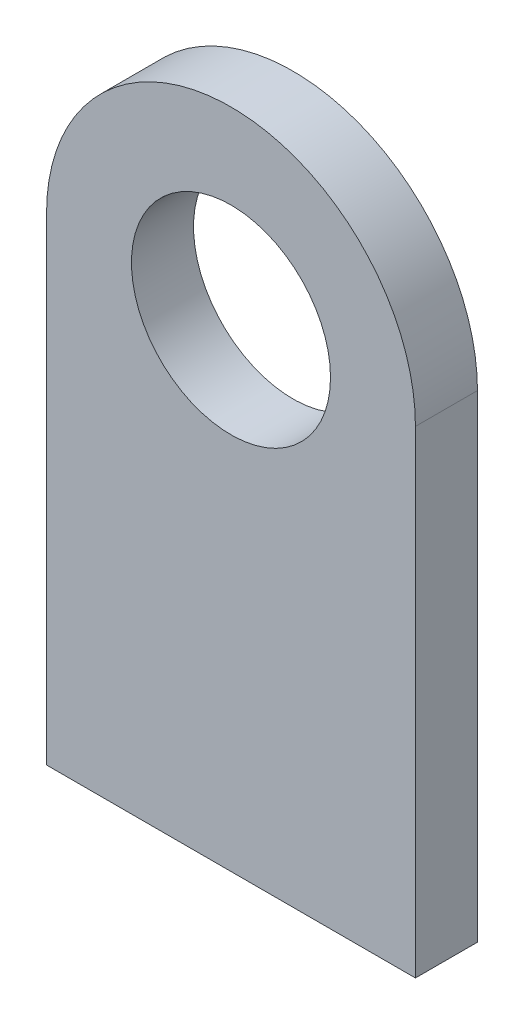
ISO-10303-21;
HEADER;
FILE_DESCRIPTION(('STEP AP214'),'2;1');
FILE_NAME('part.step','',(''),(''),'','','');
FILE_SCHEMA(('AUTOMOTIVE_DESIGN { 1 0 10303 214 1 1 1 1 }'));
ENDSEC;
DATA;
#1=APPLICATION_CONTEXT('core data for automotive mechanical design processes');
#2=APPLICATION_PROTOCOL_DEFINITION('international standard','automotive_design',2000,#1);
#3=PRODUCT_CONTEXT('',#1,'mechanical');
#4=PRODUCT('Part','Part','',(#3));
#5=PRODUCT_RELATED_PRODUCT_CATEGORY('part','',(#4));
#6=PRODUCT_DEFINITION_FORMATION('','',#4);
#7=PRODUCT_DEFINITION_CONTEXT('part definition',#1,'design');
#8=PRODUCT_DEFINITION('design','',#6,#7);
#9=PRODUCT_DEFINITION_SHAPE('','',#8);
#10=(LENGTH_UNIT() NAMED_UNIT(*) SI_UNIT(.MILLI.,.METRE.));
#11=(NAMED_UNIT(*) PLANE_ANGLE_UNIT() SI_UNIT($,.RADIAN.));
#12=(NAMED_UNIT(*) SI_UNIT($,.STERADIAN.) SOLID_ANGLE_UNIT());
#13=UNCERTAINTY_MEASURE_WITH_UNIT(LENGTH_MEASURE(1.E-05),#10,'distance_accuracy_value','');
#14=(GEOMETRIC_REPRESENTATION_CONTEXT(3) GLOBAL_UNCERTAINTY_ASSIGNED_CONTEXT((#13)) GLOBAL_UNIT_ASSIGNED_CONTEXT((#10,
#11,#12)) REPRESENTATION_CONTEXT('',''));
#15=CARTESIAN_POINT('',(0.,0.,0.));
#16=DIRECTION('',(0.,0.,1.));
#17=DIRECTION('',(1.,0.,0.));
#18=AXIS2_PLACEMENT_3D('',#15,#16,#17);
#19=CARTESIAN_POINT('',(0.,0.,9.35));
#20=DIRECTION('',(0.,0.,1.));
#21=DIRECTION('',(1.,0.,0.));
#22=AXIS2_PLACEMENT_3D('',#19,#20,#21);
#23=PLANE('',#22);
#24=CARTESIAN_POINT('',(0.,0.,9.35));
#25=DIRECTION('',(0.,0.,1.));
#26=DIRECTION('',(1.,0.,0.));
#27=AXIS2_PLACEMENT_3D('',#24,#25,#26);
#28=CIRCLE('',#27,27.8);
#29=CARTESIAN_POINT('',(27.8,0.,9.35));
#30=VERTEX_POINT('',#29);
#31=CARTESIAN_POINT('',(-27.8,0.,9.35));
#32=VERTEX_POINT('',#31);
#33=EDGE_CURVE('E98',#30,#32,#28,.T.);
#34=ORIENTED_EDGE('',*,*,#33,.T.);
#35=DIRECTION('',(0.,-1.,0.));
#36=VECTOR('',#35,1.);
#37=CARTESIAN_POINT('',(-27.8,0.,9.35));
#38=LINE('',#37,#36);
#39=CARTESIAN_POINT('',(-27.8,-72.,9.35));
#40=VERTEX_POINT('',#39);
#41=EDGE_CURVE('E93',#32,#40,#38,.T.);
#42=ORIENTED_EDGE('',*,*,#41,.T.);
#43=DIRECTION('',(1.,0.,0.));
#44=VECTOR('',#43,1.);
#45=CARTESIAN_POINT('',(-27.8,-72.,9.35));
#46=LINE('',#45,#44);
#47=CARTESIAN_POINT('',(27.8,-72.,9.35));
#48=VERTEX_POINT('',#47);
#49=EDGE_CURVE('E96',#40,#48,#46,.T.);
#50=ORIENTED_EDGE('',*,*,#49,.T.);
#51=DIRECTION('',(0.,1.,0.));
#52=VECTOR('',#51,1.);
#53=CARTESIAN_POINT('',(27.8,0.,9.35));
#54=LINE('',#53,#52);
#55=EDGE_CURVE('E63',#48,#30,#54,.T.);
#56=ORIENTED_EDGE('',*,*,#55,.T.);
#57=EDGE_LOOP('',(#34,#42,#50,#56));
#58=FACE_BOUND('',#57,.T.);
#59=CARTESIAN_POINT('',(0.,0.,9.35));
#60=DIRECTION('',(0.,0.,1.));
#61=DIRECTION('',(1.,0.,0.));
#62=AXIS2_PLACEMENT_3D('',#59,#60,#61);
#63=CIRCLE('',#62,15.);
#64=CARTESIAN_POINT('',(15.,0.,9.35));
#65=VERTEX_POINT('',#64);
#66=EDGE_CURVE('E120',#65,#65,#63,.T.);
#67=ORIENTED_EDGE('',*,*,#66,.F.);
#68=EDGE_LOOP('',(#67));
#69=FACE_BOUND('',#68,.T.);
#70=ADVANCED_FACE('F45',(#58,#69),#23,.T.);
#71=CARTESIAN_POINT('',(0.,0.,0.));
#72=DIRECTION('',(0.,0.,1.));
#73=DIRECTION('',(1.,0.,0.));
#74=AXIS2_PLACEMENT_3D('',#71,#72,#73);
#75=PLANE('',#74);
#76=CARTESIAN_POINT('',(0.,0.,0.));
#77=DIRECTION('',(0.,0.,1.));
#78=DIRECTION('',(1.,0.,0.));
#79=AXIS2_PLACEMENT_3D('',#76,#77,#78);
#80=CIRCLE('',#79,27.8);
#81=CARTESIAN_POINT('',(27.8,0.,0.));
#82=VERTEX_POINT('',#81);
#83=CARTESIAN_POINT('',(-27.8,0.,0.));
#84=VERTEX_POINT('',#83);
#85=EDGE_CURVE('E116',#82,#84,#80,.T.);
#86=ORIENTED_EDGE('',*,*,#85,.F.);
#87=DIRECTION('',(0.,1.,0.));
#88=VECTOR('',#87,1.);
#89=CARTESIAN_POINT('',(27.8,0.,0.));
#90=LINE('',#89,#88);
#91=CARTESIAN_POINT('',(27.8,-72.,0.));
#92=VERTEX_POINT('',#91);
#93=EDGE_CURVE('E86',#92,#82,#90,.T.);
#94=ORIENTED_EDGE('',*,*,#93,.F.);
#95=DIRECTION('',(1.,0.,0.));
#96=VECTOR('',#95,1.);
#97=CARTESIAN_POINT('',(-27.8,-72.,0.));
#98=LINE('',#97,#96);
#99=CARTESIAN_POINT('',(-27.8,-72.,0.));
#100=VERTEX_POINT('',#99);
#101=EDGE_CURVE('E80',#100,#92,#98,.T.);
#102=ORIENTED_EDGE('',*,*,#101,.F.);
#103=DIRECTION('',(0.,-1.,0.));
#104=VECTOR('',#103,1.);
#105=CARTESIAN_POINT('',(-27.8,0.,0.));
#106=LINE('',#105,#104);
#107=EDGE_CURVE('E103',#84,#100,#106,.T.);
#108=ORIENTED_EDGE('',*,*,#107,.F.);
#109=EDGE_LOOP('',(#86,#94,#102,#108));
#110=FACE_BOUND('',#109,.T.);
#111=CARTESIAN_POINT('',(0.,0.,0.));
#112=DIRECTION('',(0.,0.,1.));
#113=DIRECTION('',(1.,0.,0.));
#114=AXIS2_PLACEMENT_3D('',#111,#112,#113);
#115=CIRCLE('',#114,15.);
#116=CARTESIAN_POINT('',(15.,0.,0.));
#117=VERTEX_POINT('',#116);
#118=EDGE_CURVE('E142',#117,#117,#115,.T.);
#119=ORIENTED_EDGE('',*,*,#118,.T.);
#120=EDGE_LOOP('',(#119));
#121=FACE_BOUND('',#120,.T.);
#122=ADVANCED_FACE('F135',(#110,#121),#75,.F.);
#123=CARTESIAN_POINT('',(0.,0.,9.35));
#124=DIRECTION('',(0.,0.,-1.));
#125=DIRECTION('',(-1.,0.,0.));
#126=AXIS2_PLACEMENT_3D('',#123,#124,#125);
#127=CYLINDRICAL_SURFACE('',#126,27.8);
#128=ORIENTED_EDGE('',*,*,#85,.T.);
#129=DIRECTION('',(0.,0.,-1.));
#130=VECTOR('',#129,1.);
#131=CARTESIAN_POINT('',(-27.8,0.,9.35));
#132=LINE('',#131,#130);
#133=EDGE_CURVE('E11',#32,#84,#132,.T.);
#134=ORIENTED_EDGE('',*,*,#133,.F.);
#135=ORIENTED_EDGE('',*,*,#33,.F.);
#136=DIRECTION('',(0.,0.,-1.));
#137=VECTOR('',#136,1.);
#138=CARTESIAN_POINT('',(27.8,0.,9.35));
#139=LINE('',#138,#137);
#140=EDGE_CURVE('E112',#30,#82,#139,.T.);
#141=ORIENTED_EDGE('',*,*,#140,.T.);
#142=EDGE_LOOP('',(#128,#134,#135,#141));
#143=FACE_BOUND('',#142,.T.);
#144=ADVANCED_FACE('F47',(#143),#127,.T.);
#145=CARTESIAN_POINT('',(-27.8,0.,9.35));
#146=DIRECTION('',(1.,0.,0.));
#147=DIRECTION('',(0.,1.,0.));
#148=AXIS2_PLACEMENT_3D('',#145,#146,#147);
#149=PLANE('',#148);
#150=ORIENTED_EDGE('',*,*,#107,.T.);
#151=DIRECTION('',(0.,0.,-1.));
#152=VECTOR('',#151,1.);
#153=CARTESIAN_POINT('',(-27.8,-72.,9.35));
#154=LINE('',#153,#152);
#155=EDGE_CURVE('E55',#40,#100,#154,.T.);
#156=ORIENTED_EDGE('',*,*,#155,.F.);
#157=ORIENTED_EDGE('',*,*,#41,.F.);
#158=ORIENTED_EDGE('',*,*,#133,.T.);
#159=EDGE_LOOP('',(#150,#156,#157,#158));
#160=FACE_BOUND('',#159,.T.);
#161=ADVANCED_FACE('F102',(#160),#149,.F.);
#162=CARTESIAN_POINT('',(-27.8,-72.,9.35));
#163=DIRECTION('',(0.,1.,0.));
#164=DIRECTION('',(0.,0.,1.));
#165=AXIS2_PLACEMENT_3D('',#162,#163,#164);
#166=PLANE('',#165);
#167=ORIENTED_EDGE('',*,*,#101,.T.);
#168=DIRECTION('',(0.,0.,-1.));
#169=VECTOR('',#168,1.);
#170=CARTESIAN_POINT('',(27.8,-72.,9.35));
#171=LINE('',#170,#169);
#172=EDGE_CURVE('E105',#48,#92,#171,.T.);
#173=ORIENTED_EDGE('',*,*,#172,.F.);
#174=ORIENTED_EDGE('',*,*,#49,.F.);
#175=ORIENTED_EDGE('',*,*,#155,.T.);
#176=EDGE_LOOP('',(#167,#173,#174,#175));
#177=FACE_BOUND('',#176,.T.);
#178=ADVANCED_FACE('F106',(#177),#166,.F.);
#179=CARTESIAN_POINT('',(27.8,0.,9.35));
#180=DIRECTION('',(-1.,0.,0.));
#181=DIRECTION('',(0.,0.,1.));
#182=AXIS2_PLACEMENT_3D('',#179,#180,#181);
#183=PLANE('',#182);
#184=ORIENTED_EDGE('',*,*,#93,.T.);
#185=ORIENTED_EDGE('',*,*,#140,.F.);
#186=ORIENTED_EDGE('',*,*,#55,.F.);
#187=ORIENTED_EDGE('',*,*,#172,.T.);
#188=EDGE_LOOP('',(#184,#185,#186,#187));
#189=FACE_BOUND('',#188,.T.);
#190=ADVANCED_FACE('F132',(#189),#183,.F.);
#191=CARTESIAN_POINT('',(0.,0.,9.35));
#192=DIRECTION('',(0.,0.,-1.));
#193=DIRECTION('',(-1.,0.,0.));
#194=AXIS2_PLACEMENT_3D('',#191,#192,#193);
#195=CYLINDRICAL_SURFACE('',#194,15.);
#196=ORIENTED_EDGE('',*,*,#66,.T.);
#197=EDGE_LOOP('',(#196));
#198=FACE_BOUND('',#197,.T.);
#199=ORIENTED_EDGE('',*,*,#118,.F.);
#200=EDGE_LOOP('',(#199));
#201=FACE_BOUND('',#200,.T.);
#202=ADVANCED_FACE('F152',(#198,#201),#195,.F.);
#203=CLOSED_SHELL('',(#70,#122,#144,#161,#178,#190,#202));
#204=MANIFOLD_SOLID_BREP('B2',#203);
#205=ADVANCED_BREP_SHAPE_REPRESENTATION('',(#18,#204),#14);
#206=SHAPE_DEFINITION_REPRESENTATION(#9,#205);
ENDSEC;
END-ISO-10303-21;
